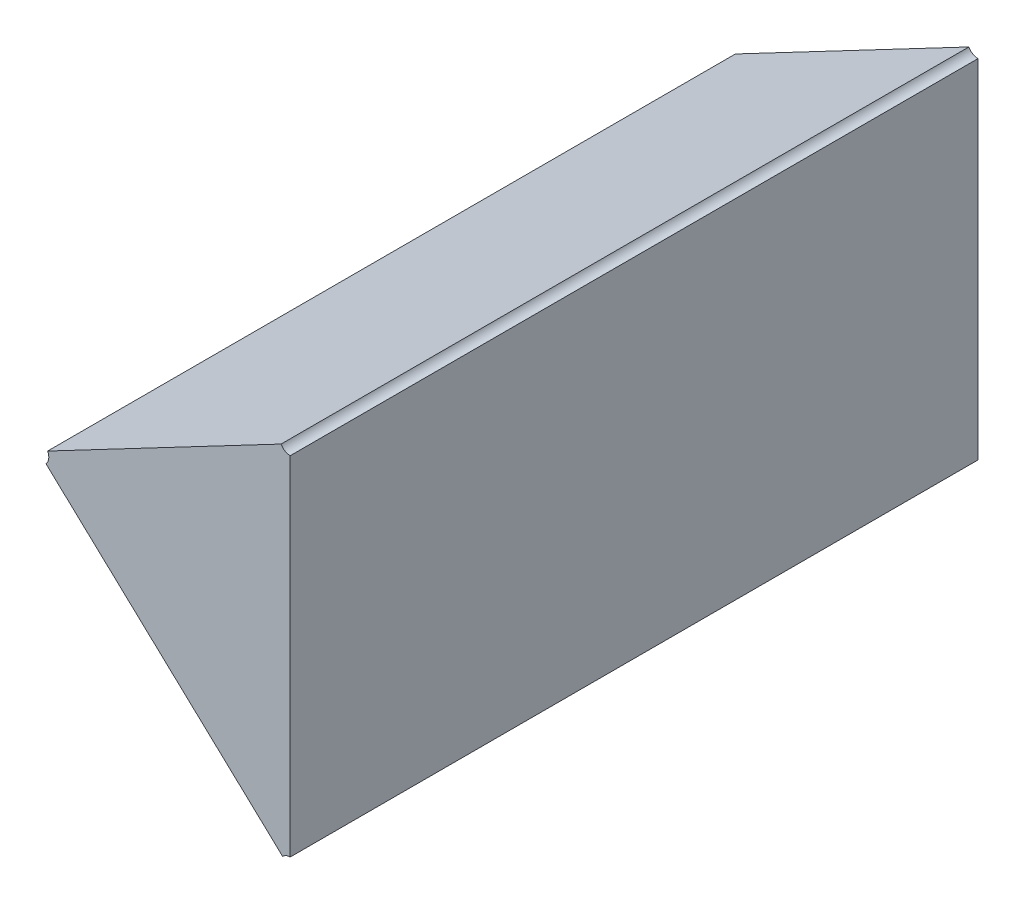
ISO-10303-21;
HEADER;
FILE_DESCRIPTION(('STEP AP214'),'2;1');
FILE_NAME('part.step','',(''),(''),'','','');
FILE_SCHEMA(('AUTOMOTIVE_DESIGN { 1 0 10303 214 1 1 1 1 }'));
ENDSEC;
DATA;
#1=APPLICATION_CONTEXT('core data for automotive mechanical design processes');
#2=APPLICATION_PROTOCOL_DEFINITION('international standard','automotive_design',2000,#1);
#3=PRODUCT_CONTEXT('',#1,'mechanical');
#4=PRODUCT('Part','Part','',(#3));
#5=PRODUCT_RELATED_PRODUCT_CATEGORY('part','',(#4));
#6=PRODUCT_DEFINITION_FORMATION('','',#4);
#7=PRODUCT_DEFINITION_CONTEXT('part definition',#1,'design');
#8=PRODUCT_DEFINITION('design','',#6,#7);
#9=PRODUCT_DEFINITION_SHAPE('','',#8);
#10=(LENGTH_UNIT() NAMED_UNIT(*) SI_UNIT(.MILLI.,.METRE.));
#11=(NAMED_UNIT(*) PLANE_ANGLE_UNIT() SI_UNIT($,.RADIAN.));
#12=(NAMED_UNIT(*) SI_UNIT($,.STERADIAN.) SOLID_ANGLE_UNIT());
#13=UNCERTAINTY_MEASURE_WITH_UNIT(LENGTH_MEASURE(1.E-05),#10,'distance_accuracy_value','');
#14=(GEOMETRIC_REPRESENTATION_CONTEXT(3) GLOBAL_UNCERTAINTY_ASSIGNED_CONTEXT((#13)) GLOBAL_UNIT_ASSIGNED_CONTEXT((#10,
#11,#12)) REPRESENTATION_CONTEXT('',''));
#15=CARTESIAN_POINT('',(0.,0.,0.));
#16=DIRECTION('',(0.,0.,1.));
#17=DIRECTION('',(1.,0.,0.));
#18=AXIS2_PLACEMENT_3D('',#15,#16,#17);
#19=CARTESIAN_POINT('',(-0.81014731056933,-0.709624283391395,0.));
#20=DIRECTION('',(0.,0.,1.));
#21=DIRECTION('',(1.,0.,0.));
#22=AXIS2_PLACEMENT_3D('',#19,#20,#21);
#23=PLANE('',#22);
#24=CARTESIAN_POINT('',(-0.798601549558721,-0.684415298028327,0.));
#25=DIRECTION('',(0.,0.,1.));
#26=DIRECTION('',(-0.885039467737878,-0.465515993867293,0.));
#27=AXIS2_PLACEMENT_3D('',#24,#25,#26);
#28=CIRCLE('',#27,0.0015);
#29=CARTESIAN_POINT('',(-0.799929108760328,-0.685113572019128,0.));
#30=VERTEX_POINT('',#29);
#31=CARTESIAN_POINT('',(-0.798601549558721,-0.685915298028327,0.));
#32=VERTEX_POINT('',#31);
#33=EDGE_CURVE('E11',#30,#32,#28,.T.);
#34=ORIENTED_EDGE('',*,*,#33,.T.);
#35=DIRECTION('',(0.,1.,0.));
#36=VECTOR('',#35,1.);
#37=CARTESIAN_POINT('',(-0.798601549558721,-0.736452270258831,0.));
#38=LINE('',#37,#36);
#39=CARTESIAN_POINT('',(-0.798601549558721,-0.736452270258831,0.));
#40=VERTEX_POINT('',#39);
#41=EDGE_CURVE('E116',#40,#32,#38,.T.);
#42=ORIENTED_EDGE('',*,*,#41,.F.);
#43=CARTESIAN_POINT('',(-0.798601549558721,-0.737952270258831,0.));
#44=DIRECTION('',(0.,0.,1.));
#45=DIRECTION('',(0.,1.,0.));
#46=AXIS2_PLACEMENT_3D('',#43,#44,#45);
#47=CIRCLE('',#46,0.0015);
#48=CARTESIAN_POINT('',(-0.799696282328893,-0.736926814183754,0.));
#49=VERTEX_POINT('',#48);
#50=EDGE_CURVE('E90',#40,#49,#47,.T.);
#51=ORIENTED_EDGE('',*,*,#50,.T.);
#52=DIRECTION('',(0.72982184678132,-0.683637383384425,0.));
#53=VECTOR('',#52,1.);
#54=CARTESIAN_POINT('',(-0.834108251064684,-0.704692497867526,0.));
#55=LINE('',#54,#53);
#56=CARTESIAN_POINT('',(-0.834108251064684,-0.704692497867526,0.));
#57=VERTEX_POINT('',#56);
#58=EDGE_CURVE('E103',#57,#49,#55,.T.);
#59=ORIENTED_EDGE('',*,*,#58,.F.);
#60=CARTESIAN_POINT('',(-0.835202983834856,-0.70366704179245,0.));
#61=DIRECTION('',(0.,0.,1.));
#62=DIRECTION('',(0.729821846781545,-0.683637383384185,0.));
#63=AXIS2_PLACEMENT_3D('',#60,#61,#62);
#64=CIRCLE('',#63,0.0015);
#65=CARTESIAN_POINT('',(-0.833875424633249,-0.702968767801649,0.));
#66=VERTEX_POINT('',#65);
#67=EDGE_CURVE('E77',#57,#66,#64,.T.);
#68=ORIENTED_EDGE('',*,*,#67,.T.);
#69=DIRECTION('',(-0.885039467737862,-0.465515993867323,0.));
#70=VECTOR('',#69,1.);
#71=CARTESIAN_POINT('',(-0.799929108760328,-0.685113572019128,0.));
#72=LINE('',#71,#70);
#73=EDGE_CURVE('E112',#30,#66,#72,.T.);
#74=ORIENTED_EDGE('',*,*,#73,.F.);
#75=EDGE_LOOP('',(#34,#42,#51,#59,#68,#74));
#76=FACE_BOUND('',#75,.T.);
#77=ADVANCED_FACE('F17',(#76),#23,.F.);
#78=CARTESIAN_POINT('',(-0.798601549558721,-0.684415298028327,0.));
#79=DIRECTION('',(-0.465515993867323,0.885039467737862,0.));
#80=DIRECTION('',(-0.885039467737862,-0.465515993867323,0.));
#81=AXIS2_PLACEMENT_3D('',#78,#79,#80);
#82=PLANE('',#81);
#83=DIRECTION('',(0.,0.,-1.));
#84=VECTOR('',#83,1.);
#85=CARTESIAN_POINT('',(-0.799929108760328,-0.685113572019128,0.1));
#86=LINE('',#85,#84);
#87=CARTESIAN_POINT('',(-0.799929108760328,-0.685113572019128,0.1));
#88=VERTEX_POINT('',#87);
#89=EDGE_CURVE('E24',#88,#30,#86,.T.);
#90=ORIENTED_EDGE('',*,*,#89,.T.);
#91=ORIENTED_EDGE('',*,*,#73,.T.);
#92=DIRECTION('',(0.,0.,1.));
#93=VECTOR('',#92,1.);
#94=CARTESIAN_POINT('',(-0.833875424633249,-0.702968767801649,0.));
#95=LINE('',#94,#93);
#96=CARTESIAN_POINT('',(-0.833875424633249,-0.702968767801649,0.1));
#97=VERTEX_POINT('',#96);
#98=EDGE_CURVE('E106',#66,#97,#95,.T.);
#99=ORIENTED_EDGE('',*,*,#98,.T.);
#100=DIRECTION('',(-0.885039467737862,-0.465515993867323,0.));
#101=VECTOR('',#100,1.);
#102=CARTESIAN_POINT('',(-0.799929108760328,-0.685113572019128,0.1));
#103=LINE('',#102,#101);
#104=EDGE_CURVE('E99',#88,#97,#103,.T.);
#105=ORIENTED_EDGE('',*,*,#104,.F.);
#106=EDGE_LOOP('',(#90,#91,#99,#105));
#107=FACE_BOUND('',#106,.T.);
#108=ADVANCED_FACE('F120',(#107),#82,.T.);
#109=CARTESIAN_POINT('',(-0.835202983834856,-0.70366704179245,0.));
#110=DIRECTION('',(-0.683637383384426,-0.729821846781319,0.));
#111=DIRECTION('',(0.729821846781319,-0.683637383384426,0.));
#112=AXIS2_PLACEMENT_3D('',#109,#110,#111);
#113=PLANE('',#112);
#114=DIRECTION('',(0.,0.,1.));
#115=VECTOR('',#114,1.);
#116=CARTESIAN_POINT('',(-0.799696282328893,-0.736926814183754,0.));
#117=LINE('',#116,#115);
#118=CARTESIAN_POINT('',(-0.799696282328893,-0.736926814183754,0.1));
#119=VERTEX_POINT('',#118);
#120=EDGE_CURVE('E114',#49,#119,#117,.T.);
#121=ORIENTED_EDGE('',*,*,#120,.T.);
#122=DIRECTION('',(0.72982184678132,-0.683637383384425,0.));
#123=VECTOR('',#122,1.);
#124=CARTESIAN_POINT('',(-0.834108251064684,-0.704692497867526,0.1));
#125=LINE('',#124,#123);
#126=CARTESIAN_POINT('',(-0.834108251064684,-0.704692497867526,0.1));
#127=VERTEX_POINT('',#126);
#128=EDGE_CURVE('E85',#127,#119,#125,.T.);
#129=ORIENTED_EDGE('',*,*,#128,.F.);
#130=DIRECTION('',(0.,0.,-1.));
#131=VECTOR('',#130,1.);
#132=CARTESIAN_POINT('',(-0.834108251064684,-0.704692497867526,0.1));
#133=LINE('',#132,#131);
#134=EDGE_CURVE('E96',#127,#57,#133,.T.);
#135=ORIENTED_EDGE('',*,*,#134,.T.);
#136=ORIENTED_EDGE('',*,*,#58,.T.);
#137=EDGE_LOOP('',(#121,#129,#135,#136));
#138=FACE_BOUND('',#137,.T.);
#139=ADVANCED_FACE('F127',(#138),#113,.T.);
#140=CARTESIAN_POINT('',(-0.81014731056933,-0.709624283391395,0.1));
#141=DIRECTION('',(0.,0.,1.));
#142=DIRECTION('',(1.,0.,0.));
#143=AXIS2_PLACEMENT_3D('',#140,#141,#142);
#144=PLANE('',#143);
#145=CARTESIAN_POINT('',(-0.798601549558721,-0.684415298028327,0.1));
#146=DIRECTION('',(0.,0.,-1.));
#147=DIRECTION('',(0.,-1.,0.));
#148=AXIS2_PLACEMENT_3D('',#145,#146,#147);
#149=CIRCLE('',#148,0.0015);
#150=CARTESIAN_POINT('',(-0.798601549558721,-0.685915298028327,0.1));
#151=VERTEX_POINT('',#150);
#152=EDGE_CURVE('E109',#151,#88,#149,.T.);
#153=ORIENTED_EDGE('',*,*,#152,.T.);
#154=ORIENTED_EDGE('',*,*,#104,.T.);
#155=CARTESIAN_POINT('',(-0.835202983834856,-0.70366704179245,0.1));
#156=DIRECTION('',(0.,0.,-1.));
#157=DIRECTION('',(0.885039467737878,0.465515993867293,0.));
#158=AXIS2_PLACEMENT_3D('',#155,#156,#157);
#159=CIRCLE('',#158,0.0015);
#160=EDGE_CURVE('E78',#97,#127,#159,.T.);
#161=ORIENTED_EDGE('',*,*,#160,.T.);
#162=ORIENTED_EDGE('',*,*,#128,.T.);
#163=CARTESIAN_POINT('',(-0.798601549558721,-0.737952270258831,0.1));
#164=DIRECTION('',(0.,0.,-1.));
#165=DIRECTION('',(-0.729821846781225,0.683637383384527,0.));
#166=AXIS2_PLACEMENT_3D('',#163,#164,#165);
#167=CIRCLE('',#166,0.0015);
#168=CARTESIAN_POINT('',(-0.798601549558721,-0.736452270258831,0.1));
#169=VERTEX_POINT('',#168);
#170=EDGE_CURVE('E82',#119,#169,#167,.T.);
#171=ORIENTED_EDGE('',*,*,#170,.T.);
#172=DIRECTION('',(0.,1.,0.));
#173=VECTOR('',#172,1.);
#174=CARTESIAN_POINT('',(-0.798601549558721,-0.736452270258831,0.1));
#175=LINE('',#174,#173);
#176=EDGE_CURVE('E67',#169,#151,#175,.T.);
#177=ORIENTED_EDGE('',*,*,#176,.T.);
#178=EDGE_LOOP('',(#153,#154,#161,#162,#171,#177));
#179=FACE_BOUND('',#178,.T.);
#180=ADVANCED_FACE('F83',(#179),#144,.T.);
#181=CARTESIAN_POINT('',(-0.798601549558721,-0.737952270258831,0.));
#182=DIRECTION('',(1.,0.,0.));
#183=DIRECTION('',(0.,1.,0.));
#184=AXIS2_PLACEMENT_3D('',#181,#182,#183);
#185=PLANE('',#184);
#186=DIRECTION('',(0.,0.,1.));
#187=VECTOR('',#186,1.);
#188=CARTESIAN_POINT('',(-0.798601549558721,-0.685915298028327,0.));
#189=LINE('',#188,#187);
#190=EDGE_CURVE('E74',#32,#151,#189,.T.);
#191=ORIENTED_EDGE('',*,*,#190,.T.);
#192=ORIENTED_EDGE('',*,*,#176,.F.);
#193=DIRECTION('',(0.,0.,-1.));
#194=VECTOR('',#193,1.);
#195=CARTESIAN_POINT('',(-0.798601549558721,-0.736452270258831,0.1));
#196=LINE('',#195,#194);
#197=EDGE_CURVE('E71',#169,#40,#196,.T.);
#198=ORIENTED_EDGE('',*,*,#197,.T.);
#199=ORIENTED_EDGE('',*,*,#41,.T.);
#200=EDGE_LOOP('',(#191,#192,#198,#199));
#201=FACE_BOUND('',#200,.T.);
#202=ADVANCED_FACE('F69',(#201),#185,.T.);
#203=CARTESIAN_POINT('',(-0.835202983834856,-0.70366704179245,0.1));
#204=DIRECTION('',(0.,0.,1.));
#205=DIRECTION('',(-1.,0.,0.));
#206=AXIS2_PLACEMENT_3D('',#203,#204,#205);
#207=CYLINDRICAL_SURFACE('',#206,0.0015);
#208=ORIENTED_EDGE('',*,*,#98,.F.);
#209=ORIENTED_EDGE('',*,*,#67,.F.);
#210=ORIENTED_EDGE('',*,*,#134,.F.);
#211=ORIENTED_EDGE('',*,*,#160,.F.);
#212=EDGE_LOOP('',(#208,#209,#210,#211));
#213=FACE_BOUND('',#212,.T.);
#214=ADVANCED_FACE('F124',(#213),#207,.F.);
#215=CARTESIAN_POINT('',(-0.798601549558721,-0.737952270258831,0.1));
#216=DIRECTION('',(0.,0.,1.));
#217=DIRECTION('',(-1.,0.,0.));
#218=AXIS2_PLACEMENT_3D('',#215,#216,#217);
#219=CYLINDRICAL_SURFACE('',#218,0.0015);
#220=ORIENTED_EDGE('',*,*,#120,.F.);
#221=ORIENTED_EDGE('',*,*,#50,.F.);
#222=ORIENTED_EDGE('',*,*,#197,.F.);
#223=ORIENTED_EDGE('',*,*,#170,.F.);
#224=EDGE_LOOP('',(#220,#221,#222,#223));
#225=FACE_BOUND('',#224,.T.);
#226=ADVANCED_FACE('F89',(#225),#219,.F.);
#227=CARTESIAN_POINT('',(-0.798601549558721,-0.684415298028327,0.1));
#228=DIRECTION('',(0.,0.,1.));
#229=DIRECTION('',(-1.,0.,0.));
#230=AXIS2_PLACEMENT_3D('',#227,#228,#229);
#231=CYLINDRICAL_SURFACE('',#230,0.0015);
#232=ORIENTED_EDGE('',*,*,#89,.F.);
#233=ORIENTED_EDGE('',*,*,#152,.F.);
#234=ORIENTED_EDGE('',*,*,#190,.F.);
#235=ORIENTED_EDGE('',*,*,#33,.F.);
#236=EDGE_LOOP('',(#232,#233,#234,#235));
#237=FACE_BOUND('',#236,.T.);
#238=ADVANCED_FACE('F118',(#237),#231,.F.);
#239=CLOSED_SHELL('',(#77,#108,#139,#180,#202,#214,#226,#238));
#240=MANIFOLD_SOLID_BREP('B1',#239);
#241=ADVANCED_BREP_SHAPE_REPRESENTATION('',(#18,#240),#14);
#242=SHAPE_DEFINITION_REPRESENTATION(#9,#241);
ENDSEC;
END-ISO-10303-21;
